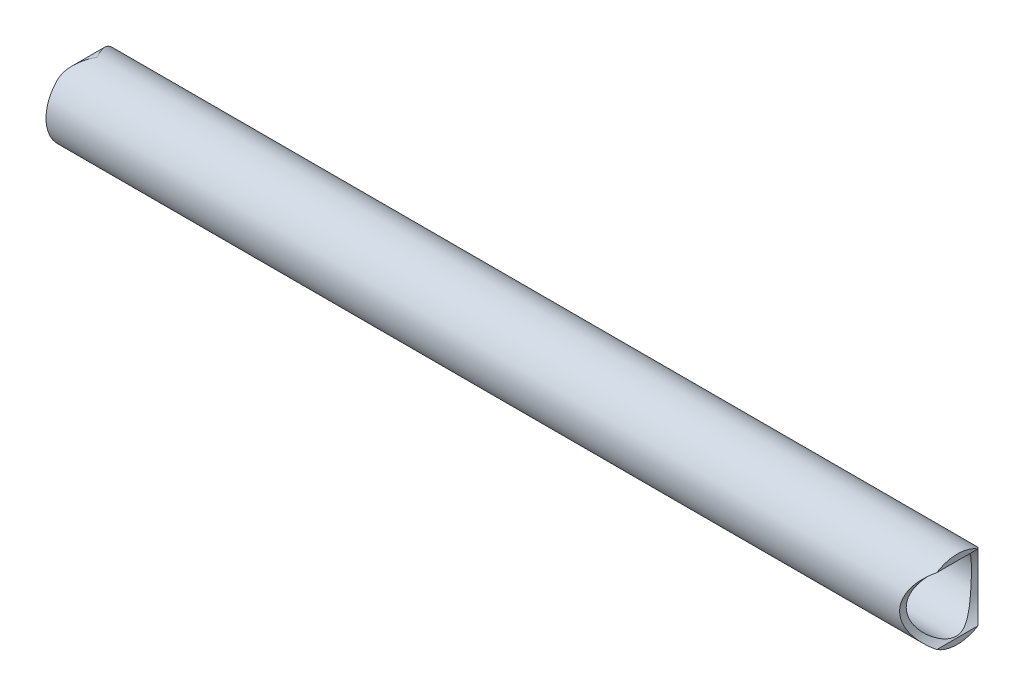
ISO-10303-21;
HEADER;
FILE_DESCRIPTION(('STEP AP214'),'2;1');
FILE_NAME('part.step','',(''),(''),'','','');
FILE_SCHEMA(('AUTOMOTIVE_DESIGN { 1 0 10303 214 1 1 1 1 }'));
ENDSEC;
DATA;
#1=APPLICATION_CONTEXT('core data for automotive mechanical design processes');
#2=APPLICATION_PROTOCOL_DEFINITION('international standard','automotive_design',2000,#1);
#3=PRODUCT_CONTEXT('',#1,'mechanical');
#4=PRODUCT('Part','Part','',(#3));
#5=PRODUCT_RELATED_PRODUCT_CATEGORY('part','',(#4));
#6=PRODUCT_DEFINITION_FORMATION('','',#4);
#7=PRODUCT_DEFINITION_CONTEXT('part definition',#1,'design');
#8=PRODUCT_DEFINITION('design','',#6,#7);
#9=PRODUCT_DEFINITION_SHAPE('','',#8);
#10=(LENGTH_UNIT() NAMED_UNIT(*) SI_UNIT(.MILLI.,.METRE.));
#11=(NAMED_UNIT(*) PLANE_ANGLE_UNIT() SI_UNIT($,.RADIAN.));
#12=(NAMED_UNIT(*) SI_UNIT($,.STERADIAN.) SOLID_ANGLE_UNIT());
#13=UNCERTAINTY_MEASURE_WITH_UNIT(LENGTH_MEASURE(1.E-05),#10,'distance_accuracy_value','');
#14=(GEOMETRIC_REPRESENTATION_CONTEXT(3) GLOBAL_UNCERTAINTY_ASSIGNED_CONTEXT((#13)) GLOBAL_UNIT_ASSIGNED_CONTEXT((#10,
#11,#12)) REPRESENTATION_CONTEXT('',''));
#15=CARTESIAN_POINT('',(0.,0.,0.));
#16=DIRECTION('',(0.,0.,1.));
#17=DIRECTION('',(1.,0.,0.));
#18=AXIS2_PLACEMENT_3D('',#15,#16,#17);
#19=CARTESIAN_POINT('',(469.10625,0.,0.));
#20=DIRECTION('',(1.,0.,0.));
#21=DIRECTION('',(0.,0.,-1.));
#22=AXIS2_PLACEMENT_3D('',#19,#20,#21);
#23=PLANE('',#22);
#24=DIRECTION('',(0.,0.,1.));
#25=VECTOR('',#24,1.);
#26=CARTESIAN_POINT('',(469.10625,17.9154421589309,-21.082));
#27=LINE('',#26,#25);
#28=CARTESIAN_POINT('',(469.10625,17.9154421589309,-11.1125));
#29=VERTEX_POINT('',#28);
#30=CARTESIAN_POINT('',(469.10625,17.915442158931,11.1125));
#31=VERTEX_POINT('',#30);
#32=EDGE_CURVE('E87',#29,#31,#27,.T.);
#33=ORIENTED_EDGE('',*,*,#32,.F.);
#34=CARTESIAN_POINT('',(469.10625,0.,0.));
#35=DIRECTION('',(1.,0.,0.));
#36=DIRECTION('',(0.,0.,-1.));
#37=AXIS2_PLACEMENT_3D('',#34,#35,#36);
#38=CIRCLE('',#37,21.082);
#39=EDGE_CURVE('E47',#29,#31,#38,.T.);
#40=ORIENTED_EDGE('',*,*,#39,.T.);
#41=EDGE_LOOP('',(#33,#40));
#42=FACE_BOUND('',#41,.T.);
#43=ADVANCED_FACE('F32',(#42),#23,.T.);
#44=DIRECTION('',(0.,0.,1.));
#45=VECTOR('',#44,1.);
#46=CARTESIAN_POINT('',(469.10625,-17.9154421589309,-21.082));
#47=LINE('',#46,#45);
#48=CARTESIAN_POINT('',(469.10625,-17.915442158931,11.1125));
#49=VERTEX_POINT('',#48);
#50=CARTESIAN_POINT('',(469.10625,-17.9154421589309,-11.1125));
#51=VERTEX_POINT('',#50);
#52=EDGE_CURVE('E84',#49,#51,#47,.F.);
#53=ORIENTED_EDGE('',*,*,#52,.F.);
#54=EDGE_CURVE('E92',#49,#51,#38,.T.);
#55=ORIENTED_EDGE('',*,*,#54,.T.);
#56=EDGE_LOOP('',(#53,#55));
#57=FACE_BOUND('',#56,.T.);
#58=ADVANCED_FACE('F91',(#57),#23,.T.);
#59=CARTESIAN_POINT('',(0.,0.,0.));
#60=DIRECTION('',(1.,0.,0.));
#61=DIRECTION('',(0.,0.,-1.));
#62=AXIS2_PLACEMENT_3D('',#59,#60,#61);
#63=PLANE('',#62);
#64=CARTESIAN_POINT('',(0.,0.,0.));
#65=DIRECTION('',(1.,0.,0.));
#66=DIRECTION('',(0.,0.,-1.));
#67=AXIS2_PLACEMENT_3D('',#64,#65,#66);
#68=CIRCLE('',#67,21.082);
#69=CARTESIAN_POINT('',(0.,14.732,15.0804144505382));
#70=VERTEX_POINT('',#69);
#71=CARTESIAN_POINT('',(0.,14.732,-15.0804144505382));
#72=VERTEX_POINT('',#71);
#73=EDGE_CURVE('E95',#70,#72,#68,.T.);
#74=ORIENTED_EDGE('',*,*,#73,.F.);
#75=DIRECTION('',(0.,0.,1.));
#76=VECTOR('',#75,1.);
#77=CARTESIAN_POINT('',(0.,14.732,-21.082));
#78=LINE('',#77,#76);
#79=CARTESIAN_POINT('',(0.,14.732,9.49362164824362));
#80=VERTEX_POINT('',#79);
#81=EDGE_CURVE('E125',#80,#70,#78,.T.);
#82=ORIENTED_EDGE('',*,*,#81,.F.);
#83=CARTESIAN_POINT('',(0.,0.,0.));
#84=DIRECTION('',(1.,0.,0.));
#85=DIRECTION('',(0.,0.,-1.));
#86=AXIS2_PLACEMENT_3D('',#83,#84,#85);
#87=CIRCLE('',#86,17.526);
#88=CARTESIAN_POINT('',(0.,14.732,-9.49362164824362));
#89=VERTEX_POINT('',#88);
#90=EDGE_CURVE('E98',#80,#89,#87,.T.);
#91=ORIENTED_EDGE('',*,*,#90,.T.);
#92=EDGE_CURVE('E61',#72,#89,#78,.T.);
#93=ORIENTED_EDGE('',*,*,#92,.F.);
#94=EDGE_LOOP('',(#74,#82,#91,#93));
#95=FACE_BOUND('',#94,.T.);
#96=ADVANCED_FACE('F138',(#95),#63,.F.);
#97=CARTESIAN_POINT('',(469.10625,0.,0.));
#98=DIRECTION('',(-1.,0.,0.));
#99=DIRECTION('',(0.,0.,1.));
#100=AXIS2_PLACEMENT_3D('',#97,#98,#99);
#101=CYLINDRICAL_SURFACE('',#100,21.082);
#102=ORIENTED_EDGE('',*,*,#73,.T.);
#103=CARTESIAN_POINT('',(0.,14.732,-15.0804144505382));
#104=CARTESIAN_POINT('',(4.99777097256306E-06,14.8585166363932,-14.9568250218965));
#105=CARTESIAN_POINT('',(0.0037804024379681,14.9834433145249,-14.8316684363902));
#106=CARTESIAN_POINT('',(0.018344612519162,15.2298802862784,-14.578499414352));
#107=CARTESIAN_POINT('',(0.0291313987626797,15.3513915529794,-14.4504878102679));
#108=CARTESIAN_POINT('',(0.0711641868780703,15.7100653220193,-14.0630095037458));
#109=CARTESIAN_POINT('',(0.112087001365868,15.9418874425845,-13.7995912481011));
#110=CARTESIAN_POINT('',(0.215488507432889,16.3879660671565,-13.2666880799684));
#111=CARTESIAN_POINT('',(0.277765297706076,16.6023646270495,-12.997281336883));
#112=CARTESIAN_POINT('',(0.420807437337394,17.0156387002352,-12.4513482602452));
#113=CARTESIAN_POINT('',(0.501584818248204,17.2145039983668,-12.1748173979638));
#114=CARTESIAN_POINT('',(0.722336490267377,17.6901137279932,-11.4788940830607));
#115=CARTESIAN_POINT('',(0.871915178025879,17.9572278098856,-11.0559422302578));
#116=CARTESIAN_POINT('',(1.19848542775072,18.4567086453977,-10.2003069203716));
#117=CARTESIAN_POINT('',(1.37548494857253,18.6890652721093,-9.76762066916));
#118=CARTESIAN_POINT('',(1.75209895067343,19.1211226362083,-8.89229878891464));
#119=CARTESIAN_POINT('',(1.9518397925665,19.3206241773796,-8.4496197349844));
#120=CARTESIAN_POINT('',(2.36824696498252,19.6862817768882,-7.55863388229215));
#121=CARTESIAN_POINT('',(2.58491234738668,19.8524397012882,-7.11032739995988));
#122=CARTESIAN_POINT('',(3.07854021979459,20.1841782782303,-6.11397748165988));
#123=CARTESIAN_POINT('',(3.35855407719812,20.3421826858222,-5.56492077807607));
#124=CARTESIAN_POINT('',(3.93195657278609,20.6121360645314,-4.46237555433802));
#125=CARTESIAN_POINT('',(4.2253492325938,20.7240710846151,-3.90888574337448));
#126=CARTESIAN_POINT('',(4.81966564824809,20.9026212412311,-2.80091191808466));
#127=CARTESIAN_POINT('',(5.12056407013035,20.9693718110366,-2.24643591433334));
#128=CARTESIAN_POINT('',(5.7263441140806,21.0587059818151,-1.13639917411688));
#129=CARTESIAN_POINT('',(6.0312234277849,21.0813141259917,-0.580839212441869));
#130=CARTESIAN_POINT('',(6.34068566822062,21.0819948744209,-0.0169715207830517));
#131=CARTESIAN_POINT('',(6.34534284661023,21.081999997751,-0.00848573804402203));
#132=CARTESIAN_POINT('',(6.35,21.082,0.));
#133=B_SPLINE_CURVE_WITH_KNOTS('',3,(#103,#104,#105,#106,#107,#108,#109,#110,#111,#112,#113,
#114,#115,#116,#117,#118,#119,#120,#121,#122,#123,#124,#125,#126,#127,#128,#129,#130,#131,#132),
.UNSPECIFIED.,.F.,.F.,(4,2,2,2,2,2,2,2,2,2,2,2,2,2,4),(0.,0.530465682198346,1.06077866603508,
2.11923257632368,3.16794284977036,4.21733708093636,5.78132496799527,7.34576765361523,
8.91937150261676,10.4928872609037,12.3996794344843,14.3070486112538,16.2086751300639,
18.1092440424708,18.1382833302831),.UNSPECIFIED.);
#134=CARTESIAN_POINT('',(6.35,21.082,0.));
#135=VERTEX_POINT('',#134);
#136=EDGE_CURVE('E124',#72,#135,#133,.T.);
#137=ORIENTED_EDGE('',*,*,#136,.T.);
#138=CARTESIAN_POINT('',(0.,14.732,15.0804144505382));
#139=CARTESIAN_POINT('',(4.99777097265902E-06,14.8585166363932,14.9568250218965));
#140=CARTESIAN_POINT('',(0.00378040243796859,14.983443314525,14.8316684363902));
#141=CARTESIAN_POINT('',(0.0183446125191639,15.2298802862785,14.5784994143519));
#142=CARTESIAN_POINT('',(0.0291313987626825,15.3513915529794,14.4504878102678));
#143=CARTESIAN_POINT('',(0.071164186878077,15.7100653220194,14.0630095037458));
#144=CARTESIAN_POINT('',(0.112087001365878,15.9418874425845,13.799591248101));
#145=CARTESIAN_POINT('',(0.215488507432905,16.3879660671565,13.2666880799683));
#146=CARTESIAN_POINT('',(0.277765297706091,16.6023646270495,12.9972813368829));
#147=CARTESIAN_POINT('',(0.420807437337405,17.0156387002352,12.4513482602451));
#148=CARTESIAN_POINT('',(0.501584818248212,17.2145039983668,12.1748173979638));
#149=CARTESIAN_POINT('',(0.722336490267378,17.6901137279932,11.4788940830607));
#150=CARTESIAN_POINT('',(0.871915178025876,17.9572278098856,11.0559422302578));
#151=CARTESIAN_POINT('',(1.19848542775071,18.4567086453976,10.2003069203717));
#152=CARTESIAN_POINT('',(1.37548494857251,18.6890652721093,9.76762066916005));
#153=CARTESIAN_POINT('',(1.75209895067341,19.1211226362082,8.89229878891469));
#154=CARTESIAN_POINT('',(1.95183979256649,19.3206241773795,8.44961973498444));
#155=CARTESIAN_POINT('',(2.36824696498251,19.6862817768881,7.55863388229216));
#156=CARTESIAN_POINT('',(2.58491234738667,19.8524397012882,7.11032739995988));
#157=CARTESIAN_POINT('',(3.0785402197946,20.1841782782303,6.11397748165988));
#158=CARTESIAN_POINT('',(3.35855407719814,20.3421826858222,5.56492077807609));
#159=CARTESIAN_POINT('',(3.93195657278606,20.6121360645314,4.462375554338));
#160=CARTESIAN_POINT('',(4.22534923259369,20.7240710846151,3.90888574337441));
#161=CARTESIAN_POINT('',(4.81966564824822,20.9026212412311,2.80091191808473));
#162=CARTESIAN_POINT('',(5.12056407013078,20.9693718110366,2.24643591433359));
#163=CARTESIAN_POINT('',(5.72634411408013,21.0587059818151,1.13639917411665));
#164=CARTESIAN_POINT('',(6.03122342778322,21.0813141259917,0.580839212440988));
#165=CARTESIAN_POINT('',(6.34068566822056,21.0819948744209,0.0169715207830728));
#166=CARTESIAN_POINT('',(6.3453428466102,21.081999997751,0.00848573804405541));
#167=CARTESIAN_POINT('',(6.35,21.082,0.));
#168=B_SPLINE_CURVE_WITH_KNOTS('',3,(#138,#139,#140,#141,#142,#143,#144,#145,#146,#147,#148,
#149,#150,#151,#152,#153,#154,#155,#156,#157,#158,#159,#160,#161,#162,#163,#164,#165,#166,#167),
.UNSPECIFIED.,.F.,.F.,(4,2,2,2,2,2,2,2,2,2,2,2,2,2,4),(0.,0.530465682198373,1.06077866603513,
2.11923257632378,3.16794284977042,4.21733708093637,5.78132496799524,7.34576765361516,
8.91937150261673,10.4928872609037,12.3996794344843,14.3070486112539,16.2086751300639,
18.1092440424708,18.1382833302831),.UNSPECIFIED.);
#169=EDGE_CURVE('E117',#135,#70,#168,.F.);
#170=ORIENTED_EDGE('',*,*,#169,.T.);
#171=EDGE_LOOP('',(#102,#137,#170));
#172=FACE_BOUND('',#171,.T.);
#173=ORIENTED_EDGE('',*,*,#39,.F.);
#174=CARTESIAN_POINT('',(480.21875,0.,0.));
#175=DIRECTION('',(-0.707106781186548,0.,0.707106781186547));
#176=DIRECTION('',(-0.707106781186548,0.,-0.707106781186547));
#177=AXIS2_PLACEMENT_3D('',#174,#175,#176);
#178=ELLIPSE('',#177,29.8144503219496,21.082);
#179=EDGE_CURVE('E94',#29,#51,#178,.T.);
#180=ORIENTED_EDGE('',*,*,#179,.T.);
#181=ORIENTED_EDGE('',*,*,#54,.F.);
#182=CARTESIAN_POINT('',(480.21875,0.,0.));
#183=DIRECTION('',(-0.707106781186548,0.,-0.707106781186547));
#184=DIRECTION('',(-0.707106781186548,0.,0.707106781186547));
#185=AXIS2_PLACEMENT_3D('',#182,#183,#184);
#186=ELLIPSE('',#185,29.8144503219496,21.082);
#187=EDGE_CURVE('E54',#49,#31,#186,.T.);
#188=ORIENTED_EDGE('',*,*,#187,.T.);
#189=EDGE_LOOP('',(#173,#180,#181,#188));
#190=FACE_BOUND('',#189,.T.);
#191=ADVANCED_FACE('F34',(#172,#190),#101,.T.);
#192=CARTESIAN_POINT('',(469.10625,0.,0.));
#193=DIRECTION('',(-1.,0.,0.));
#194=DIRECTION('',(0.,0.,1.));
#195=AXIS2_PLACEMENT_3D('',#192,#193,#194);
#196=CYLINDRICAL_SURFACE('',#195,17.526);
#197=CARTESIAN_POINT('',(459.13675,0.,17.526));
#198=CARTESIAN_POINT('',(459.136753100232,0.416555730228906,17.525996813955));
#199=CARTESIAN_POINT('',(459.149123313981,0.833163012071545,17.5111221446535));
#200=CARTESIAN_POINT('',(459.198320724751,1.66285085098589,17.4518957288154));
#201=CARTESIAN_POINT('',(459.235152005793,2.0759308074684,17.4075390599622));
#202=CARTESIAN_POINT('',(459.332452439066,2.89546158233793,17.2901260170745));
#203=CARTESIAN_POINT('',(459.392938843433,3.30190733638105,17.2170486963236));
#204=CARTESIAN_POINT('',(459.536212942405,4.10484124386305,17.0434647188049));
#205=CARTESIAN_POINT('',(459.619000210819,4.50132958743919,16.9429585862272));
#206=CARTESIAN_POINT('',(459.804608337995,5.27944797465432,16.7167963170662));
#207=CARTESIAN_POINT('',(459.907303655403,5.66115402240748,16.5912976561353));
#208=CARTESIAN_POINT('',(460.13114125938,6.41026860382347,16.3165047587702));
#209=CARTESIAN_POINT('',(460.252283245215,6.77767737045173,16.1672109102661));
#210=CARTESIAN_POINT('',(460.510997114563,7.49674702968466,15.8465909890381));
#211=CARTESIAN_POINT('',(460.648570010029,7.84840695050787,15.6752635592522));
#212=CARTESIAN_POINT('',(460.938082247339,8.53495429518089,15.3122852034019));
#213=CARTESIAN_POINT('',(461.090024633481,8.86983814178559,15.1206299696701));
#214=CARTESIAN_POINT('',(461.464140089599,9.64160099861961,14.6449374869007));
#215=CARTESIAN_POINT('',(461.691652769384,10.0709113512938,14.3527749107548));
#216=CARTESIAN_POINT('',(462.164488465582,10.8958978241818,13.7370028939555));
#217=CARTESIAN_POINT('',(462.409817485787,11.2915625079794,13.4133828401386));
#218=CARTESIAN_POINT('',(462.913798875036,12.049775776248,12.7366579401323));
#219=CARTESIAN_POINT('',(463.17248335067,12.4122381349312,12.3834806406871));
#220=CARTESIAN_POINT('',(463.697391944567,13.102805813699,11.6503545982694));
#221=CARTESIAN_POINT('',(463.963615114459,13.4309154311957,11.2704092138659));
#222=CARTESIAN_POINT('',(464.503016862729,14.0584742968281,10.4776077506457));
#223=CARTESIAN_POINT('',(464.776233749344,14.3572918160694,10.0642778803075));
#224=CARTESIAN_POINT('',(465.318313078632,14.9191165849368,9.21095532717234));
#225=CARTESIAN_POINT('',(465.587174038226,15.1821118547605,8.77095379548327));
#226=CARTESIAN_POINT('',(466.111691041438,15.6706637077535,7.86481925902692));
#227=CARTESIAN_POINT('',(466.367377460908,15.8963093356672,7.39875205622169));
#228=CARTESIAN_POINT('',(466.855669817722,16.3089147666568,6.43838077354218));
#229=CARTESIAN_POINT('',(467.088295378546,16.4959076106971,5.94410127510899));
#230=CARTESIAN_POINT('',(467.419892415188,16.7529770224336,5.15602712210236));
#231=CARTESIAN_POINT('',(467.531806838252,16.837735543251,4.872411200417));
#232=CARTESIAN_POINT('',(467.741705453925,16.9938564773723,4.29634473218566));
#233=CARTESIAN_POINT('',(467.83968784338,17.0652171570416,4.00389304799845));
#234=CARTESIAN_POINT('',(468.018453347219,17.1934754104678,3.41127303424146));
#235=CARTESIAN_POINT('',(468.099269928926,17.2504011700851,3.11112102298287));
#236=CARTESIAN_POINT('',(468.240783138788,17.3489622258268,2.503748224318));
#237=CARTESIAN_POINT('',(468.301490351692,17.3906055672393,2.19653124698383));
#238=CARTESIAN_POINT('',(468.400642338332,17.4581424184477,1.57275012439623));
#239=CARTESIAN_POINT('',(468.438798088988,17.4838316609619,1.25611705495765));
#240=CARTESIAN_POINT('',(468.489564384314,17.517930419636,0.619877416859227));
#241=CARTESIAN_POINT('',(468.502177230519,17.526341492641,0.300271118708478));
#242=CARTESIAN_POINT('',(468.501123738161,17.5256372212721,-0.338900631657943));
#243=CARTESIAN_POINT('',(468.487455708289,17.5165207489109,-0.658466079921118));
#244=CARTESIAN_POINT('',(468.434638550502,17.4810304342677,-1.29450990358539));
#245=CARTESIAN_POINT('',(468.395486264212,17.454654452937,-1.61098789140883));
#246=CARTESIAN_POINT('',(468.289324257895,17.3822895125155,-2.26597180787558));
#247=CARTESIAN_POINT('',(468.220160695607,17.3347748801548,-2.6039563959663));
#248=CARTESIAN_POINT('',(468.05798050578,17.2213863424108,-3.27094152568147));
#249=CARTESIAN_POINT('',(467.964960013026,17.1555094618906,-3.59994060193884));
#250=CARTESIAN_POINT('',(467.758998964524,17.0065131076897,-4.24855727345));
#251=CARTESIAN_POINT('',(467.64600613574,16.9233482836622,-4.56814761827544));
#252=CARTESIAN_POINT('',(467.404253660727,16.7410384013215,-5.19667563423267));
#253=CARTESIAN_POINT('',(467.275487866865,16.6418871073676,-5.50560909125264));
#254=CARTESIAN_POINT('',(466.927147015409,16.3663636741079,-6.28987340285503));
#255=CARTESIAN_POINT('',(466.698405644521,16.1786783054546,-6.75718011774374));
#256=CARTESIAN_POINT('',(466.221976191773,15.7683263145676,-7.66612047395263));
#257=CARTESIAN_POINT('',(465.974277188512,15.5456394491178,-8.10773905469757));
#258=CARTESIAN_POINT('',(465.468372952079,15.0664754392744,-8.96683638051191));
#259=CARTESIAN_POINT('',(465.21015403316,14.8099532398125,-9.38428185098054));
#260=CARTESIAN_POINT('',(464.690466965766,14.2641231324516,-10.1948087082538));
#261=CARTESIAN_POINT('',(464.428999471574,13.9748217341554,-10.5878949086503));
#262=CARTESIAN_POINT('',(463.895324879337,13.348195218157,-11.368790869149));
#263=CARTESIAN_POINT('',(463.623240901127,13.0091843032674,-11.7553355433847));
#264=CARTESIAN_POINT('',(463.087541373633,12.2951909614096,-12.5002060187878));
#265=CARTESIAN_POINT('',(462.823927094039,11.9202031744408,-12.8585276006225));
#266=CARTESIAN_POINT('',(462.311174827839,11.1350258886843,-13.5441070863272));
#267=CARTESIAN_POINT('',(462.062010084927,10.7249051788906,-13.8714231651622));
#268=CARTESIAN_POINT('',(461.7029705029,10.0834868401277,-14.3371461507588));
#269=CARTESIAN_POINT('',(461.585752726259,9.8653306424743,-14.4881649831134));
#270=CARTESIAN_POINT('',(461.356837871324,9.42027707168284,-14.7814103315513));
#271=CARTESIAN_POINT('',(461.245142151037,9.19337757252926,-14.9236346869964));
#272=CARTESIAN_POINT('',(460.973493112914,8.61498224084044,-15.2678084182525));
#273=CARTESIAN_POINT('',(460.817459068209,8.25811349099297,-15.4639027842676));
#274=CARTESIAN_POINT('',(460.521964191443,7.52616004996061,-15.8330525436508));
#275=CARTESIAN_POINT('',(460.382499423159,7.15107971509298,-16.0061134100713));
#276=CARTESIAN_POINT('',(460.122537175912,6.38410638575886,-16.3271734823368));
#277=CARTESIAN_POINT('',(460.00203301395,5.99221937735624,-16.4751815198914));
#278=CARTESIAN_POINT('',(459.782250109816,5.19343454244432,-16.7441479493523));
#279=CARTESIAN_POINT('',(459.682971726726,4.78653646212599,-16.8651058836479));
#280=CARTESIAN_POINT('',(459.507089403541,3.95712937963007,-17.0788335101842));
#281=CARTESIAN_POINT('',(459.430663185674,3.53452536865489,-17.1713824047497));
#282=CARTESIAN_POINT('',(459.30330895774,2.67986601870688,-17.325342710614));
#283=CARTESIAN_POINT('',(459.252380994275,2.24781066246181,-17.3867540650041));
#284=CARTESIAN_POINT('',(459.177324216148,1.37821649825806,-17.4771905064637));
#285=CARTESIAN_POINT('',(459.153182158585,0.940680508218323,-17.5062315973617));
#286=CARTESIAN_POINT('',(459.132290012414,0.0640313485043037,-17.5313661812511));
#287=CARTESIAN_POINT('',(459.135537074792,-0.37508165237985,-17.5274631010918));
#288=CARTESIAN_POINT('',(459.167335633984,-1.19930498558239,-17.4891990815668));
#289=CARTESIAN_POINT('',(459.192874675364,-1.58470875998572,-17.4584640327402));
#290=CARTESIAN_POINT('',(459.264684232639,-2.35069997583225,-17.3719144045829));
#291=CARTESIAN_POINT('',(459.310952802018,-2.73128786604044,-17.3161021800126));
#292=CARTESIAN_POINT('',(459.42332254399,-3.48513791526224,-17.1802563891461));
#293=CARTESIAN_POINT('',(459.489424907109,-3.85839963308743,-17.1002213688688));
#294=CARTESIAN_POINT('',(459.64024630486,-4.59536738648546,-16.9170761014037));
#295=CARTESIAN_POINT('',(459.724966273857,-4.95907294143571,-16.813964696073));
#296=CARTESIAN_POINT('',(459.913145504431,-5.68108005964255,-16.5840874699882));
#297=CARTESIAN_POINT('',(460.016895992016,-6.03918783157445,-16.4569529541794));
#298=CARTESIAN_POINT('',(460.240467917882,-6.74203119401674,-16.1817226350541));
#299=CARTESIAN_POINT('',(460.360289050715,-7.08676703852215,-16.033627230131));
#300=CARTESIAN_POINT('',(460.614268706947,-7.7617711253795,-15.7179651464271));
#301=CARTESIAN_POINT('',(460.748429245294,-8.09203732526567,-15.5503957309038));
#302=CARTESIAN_POINT('',(461.029307650088,-8.73727082208682,-15.1972398091077));
#303=CARTESIAN_POINT('',(461.176028031205,-9.05223503545283,-15.0116496938153));
#304=CARTESIAN_POINT('',(461.548812920572,-9.80464712063615,-14.5364034891831));
#305=CARTESIAN_POINT('',(461.780846995919,-10.2333578451482,-14.2375288779349));
#306=CARTESIAN_POINT('',(462.262358234905,-11.0565036944503,-13.6081978996813));
#307=CARTESIAN_POINT('',(462.511842112484,-11.4509254939542,-13.2777293585403));
#308=CARTESIAN_POINT('',(463.023748955069,-12.2062013475731,-12.5869774042746));
#309=CARTESIAN_POINT('',(463.286207884647,-12.5669530526875,-12.2266089972621));
#310=CARTESIAN_POINT('',(463.817996141297,-13.253470559835,-11.4788424530418));
#311=CARTESIAN_POINT('',(464.08732447637,-13.5792413783913,-11.091448204724));
#312=CARTESIAN_POINT('',(464.631962798302,-14.2012900820747,-10.2834169092844));
#313=CARTESIAN_POINT('',(464.907294003942,-14.4969406813881,-9.8623113113111));
#314=CARTESIAN_POINT('',(465.452322074852,-15.0517275612925,-8.99289776114401));
#315=CARTESIAN_POINT('',(465.722016777624,-15.3108500388738,-8.54457961710635));
#316=CARTESIAN_POINT('',(466.246222682617,-15.7906628138659,-7.62139093429989));
#317=CARTESIAN_POINT('',(466.500775922646,-16.0114631279653,-7.14660175430663));
#318=CARTESIAN_POINT('',(466.984149383237,-16.4132437140876,-6.16809279152978));
#319=CARTESIAN_POINT('',(467.212994501134,-16.5942626782093,-5.6644017261431));
#320=CARTESIAN_POINT('',(467.533166365567,-16.8388425611419,-4.86810478458098));
#321=CARTESIAN_POINT('',(467.63901918611,-16.9179225696371,-4.58604260557915));
#322=CARTESIAN_POINT('',(467.836250596365,-17.062806654192,-4.01353560636163));
#323=CARTESIAN_POINT('',(467.92763123726,-17.1286126119829,-3.72309198098292));
#324=CARTESIAN_POINT('',(468.092782938295,-17.2459247048064,-3.13503376582409));
#325=CARTESIAN_POINT('',(468.166590343537,-17.2974603903694,-2.83743540296246));
#326=CARTESIAN_POINT('',(468.29389080646,-17.3854671554674,-2.23575303013736));
#327=CARTESIAN_POINT('',(468.347389138256,-17.4219421463683,-1.93167072569972));
#328=CARTESIAN_POINT('',(468.432050986908,-17.4793343349965,-1.31542257105261));
#329=CARTESIAN_POINT('',(468.462959056324,-17.5000736934338,-1.00320440672016));
#330=CARTESIAN_POINT('',(468.499785417953,-17.524756770186,-0.376634351053846));
#331=CARTESIAN_POINT('',(468.505705534394,-17.5287017145648,-0.0622826171578791));
#332=CARTESIAN_POINT('',(468.492219236601,-17.519682115217,0.565765427557123));
#333=CARTESIAN_POINT('',(468.472801625762,-17.5067100959756,0.87946138722474));
#334=CARTESIAN_POINT('',(468.409708218613,-17.4642111799082,1.50326166249684));
#335=CARTESIAN_POINT('',(468.366029014212,-17.4346819572413,1.8133654672525));
#336=CARTESIAN_POINT('',(468.24947913328,-17.3549094765865,2.46783373112703));
#337=CARTESIAN_POINT('',(468.173539424602,-17.302463431889,2.81137909094881));
#338=CARTESIAN_POINT('',(467.99769360765,-17.1787080018257,3.48874159064592));
#339=CARTESIAN_POINT('',(467.897782550923,-17.1073947213456,3.82255670590954));
#340=CARTESIAN_POINT('',(467.678186596836,-16.947078987979,4.48018532937914));
#341=CARTESIAN_POINT('',(467.55845074705,-16.8580308311813,4.80397044519033));
#342=CARTESIAN_POINT('',(467.303531095877,-16.6635408359202,5.44039078400235));
#343=CARTESIAN_POINT('',(467.168341323107,-16.5580926547885,5.75302163536546));
#344=CARTESIAN_POINT('',(466.803678142386,-16.2655608949425,6.54686642927639));
#345=CARTESIAN_POINT('',(466.565311783285,-16.0668060807317,7.0197186237903));
#346=CARTESIAN_POINT('',(466.070778251224,-15.6331071713109,7.93883090279246));
#347=CARTESIAN_POINT('',(465.814601013657,-15.3981425218364,8.38507568297595));
#348=CARTESIAN_POINT('',(465.292991177891,-14.8931005076266,9.25247800104897));
#349=CARTESIAN_POINT('',(465.027546784682,-14.6229771058186,9.67360157184695));
#350=CARTESIAN_POINT('',(464.49479644847,-14.0485414814654,10.4903942108924));
#351=CARTESIAN_POINT('',(464.227490886297,-13.7442360709218,10.8860683262347));
#352=CARTESIAN_POINT('',(463.685008627962,-13.0872302237909,11.6686564771624));
#353=CARTESIAN_POINT('',(463.410011314537,-12.7329783860628,12.0543962817461));
#354=CARTESIAN_POINT('',(462.870324829164,-11.9872775461265,12.7961902436962));
#355=CARTESIAN_POINT('',(462.60563734665,-11.5958224834142,13.1522395466039));
#356=CARTESIAN_POINT('',(462.092856716602,-10.776623787392,13.8313916713883));
#357=CARTESIAN_POINT('',(461.844731277596,-10.3489546907981,14.1545592898452));
#358=CARTESIAN_POINT('',(461.489058671317,-9.6805538418048,14.6123392874479));
#359=CARTESIAN_POINT('',(461.373266967441,-9.45330032462178,14.7604208100894));
#360=CARTESIAN_POINT('',(461.147843154438,-8.98986303225831,15.0471693205303));
#361=CARTESIAN_POINT('',(461.03821252428,-8.7536771354263,15.1858340494738));
#362=CARTESIAN_POINT('',(460.777882456114,-8.16388969440334,15.5135810654738));
#363=CARTESIAN_POINT('',(460.631019615212,-7.80547285234025,15.6971201066552));
#364=CARTESIAN_POINT('',(460.354258282389,-7.07152507053722,16.0411475968501));
#365=CARTESIAN_POINT('',(460.224355748624,-6.69599823719479,16.2016415386992));
#366=CARTESIAN_POINT('',(459.983865788701,-5.92969186792639,16.4975121757086));
#367=CARTESIAN_POINT('',(459.873255954141,-5.53893068115682,16.6329180221441));
#368=CARTESIAN_POINT('',(459.673317296928,-4.74382214338575,16.8768969338328));
#369=CARTESIAN_POINT('',(459.583984673672,-4.33947723349805,16.9854747913174));
#370=CARTESIAN_POINT('',(459.445844180231,-3.61139042732534,17.1529959877094));
#371=CARTESIAN_POINT('',(459.392441530083,-3.2898093654496,17.2176086822695));
#372=CARTESIAN_POINT('',(459.300313709527,-2.64139463379433,17.3289327236608));
#373=CARTESIAN_POINT('',(459.261591366206,-2.31455996491102,17.3756406224611));
#374=CARTESIAN_POINT('',(459.199400717763,-1.657300955975,17.4505998410856));
#375=CARTESIAN_POINT('',(459.175933854947,-1.32687627951213,17.4788494157967));
#376=CARTESIAN_POINT('',(459.144609151471,-0.66431170552806,17.5165484873698));
#377=CARTESIAN_POINT('',(459.136747527795,-0.332172243283639,17.5260025406341));
#378=CARTESIAN_POINT('',(459.13675,0.,17.526));
#379=B_SPLINE_CURVE_WITH_KNOTS('',3,(#197,#198,#199,#200,#201,#202,#203,#204,#205,#206,#207,
#208,#209,#210,#211,#212,#213,#214,#215,#216,#217,#218,#219,#220,#221,#222,#223,#224,#225,#226,
#227,#228,#229,#230,#231,#232,#233,#234,#235,#236,#237,#238,#239,#240,#241,#242,#243,#244,#245,
#246,#247,#248,#249,#250,#251,#252,#253,#254,#255,#256,#257,#258,#259,#260,#261,#262,#263,#264,
#265,#266,#267,#268,#269,#270,#271,#272,#273,#274,#275,#276,#277,#278,#279,#280,#281,#282,#283,
#284,#285,#286,#287,#288,#289,#290,#291,#292,#293,#294,#295,#296,#297,#298,#299,#300,#301,#302,
#303,#304,#305,#306,#307,#308,#309,#310,#311,#312,#313,#314,#315,#316,#317,#318,#319,#320,#321,
#322,#323,#324,#325,#326,#327,#328,#329,#330,#331,#332,#333,#334,#335,#336,#337,#338,#339,#340,
#341,#342,#343,#344,#345,#346,#347,#348,#349,#350,#351,#352,#353,#354,#355,#356,#357,#358,#359,
#360,#361,#362,#363,#364,#365,#366,#367,#368,#369,#370,#371,#372,#373,#374,#375,#376,#377,#378),
.UNSPECIFIED.,.T.,.F.,(4,2,2,2,2,2,2,2,2,2,2,2,2,2,2,2,2,2,2,2,2,2,2,2,2,2,2,2,2,2,2,2,2,2,2,2,
2,2,2,2,2,2,2,2,2,2,2,2,2,2,2,2,2,2,2,2,2,2,2,2,2,2,2,2,2,2,2,2,2,2,2,2,2,2,2,2,2,2,2,2,2,2,2,2,
2,2,2,2,2,2,4),(0.,1.24931215514068,2.49883294793602,3.74926674484587,4.99967664647633,
6.24244384055415,7.48519077601582,8.72801428973392,9.97110169852848,11.6694991969452,
13.3684717049052,15.0717382323203,16.7747914316099,18.508900041403,20.2435871614538,
21.974077138334,23.7030816933734,24.6518793950268,25.6007997833557,26.5478527733324,
27.4944064783684,28.4528421356183,29.4111914294722,30.3696024000782,31.3281321733839,
32.3712679495731,33.4145728378166,34.4606499010713,35.5071359859366,37.1638893836605,
38.8216045193316,40.4815497807695,42.1411659704712,43.8844508919193,45.6279959405214,
47.3682019789461,48.238133531576,49.1082779678088,50.4151915777868,51.7217940919451,
53.0279350344375,54.3340980714494,55.6501696985348,56.9662437309291,58.2816668085292,
59.5969530576398,60.7579780281908,61.9188940006416,63.0798796712698,64.240923621771,
65.4214962902465,66.6020465231705,67.7827628635306,68.9637161565106,70.6766447530631,
72.3902360758568,74.1088773225334,75.8272717729951,77.5762157648221,79.3258188748362,
81.0703129492533,82.8131027115062,83.7469352207905,84.6806352566832,85.6123870984828,
86.5438968054863,87.4857834704328,88.4276013724583,89.3698355997799,90.3122022187916,
91.3777285366849,92.4434750028669,93.5120043575646,94.5809479956882,96.2751844313667,
97.9703861554526,99.6678303471317,101.364936859805,103.137598327809,104.910549063673,
106.679935458133,107.564410898222,108.449097758104,109.733689326203,111.01797419982,
112.300757301213,113.58331109564,114.579500372221,115.575881394522,116.57235660447,
117.568590219854),.UNSPECIFIED.);
#380=CARTESIAN_POINT('',(459.13675,0.,17.526));
#381=VERTEX_POINT('',#380);
#382=EDGE_CURVE('E37',#381,#381,#379,.T.);
#383=ORIENTED_EDGE('',*,*,#382,.F.);
#384=EDGE_LOOP('',(#383));
#385=FACE_BOUND('',#384,.T.);
#386=CARTESIAN_POINT('',(0.,14.732,-9.49362164824361));
#387=CARTESIAN_POINT('',(1.18215827092096E-05,14.8512065552147,-9.30864758850528));
#388=CARTESIAN_POINT('',(0.00335629290756961,14.966903733683,-9.12145207419103));
#389=CARTESIAN_POINT('',(0.015618373053566,15.191067778283,-8.74302268186063));
#390=CARTESIAN_POINT('',(0.024534469369689,15.2995365978256,-8.55178991342886));
#391=CARTESIAN_POINT('',(0.0468365894807759,15.5089823218411,-8.16580160022169));
#392=CARTESIAN_POINT('',(0.0602176995159619,15.6099673136364,-7.97105014964136));
#393=CARTESIAN_POINT('',(0.0904463086584942,15.8044598611726,-7.57811282719616));
#394=CARTESIAN_POINT('',(0.107294062917175,15.8979668658161,-7.3799267035169));
#395=CARTESIAN_POINT('',(0.161710749515973,16.1677428894095,-6.77922295697602));
#396=CARTESIAN_POINT('',(0.203066270989696,16.3325710230985,-6.37184299640371));
#397=CARTESIAN_POINT('',(0.28865530712156,16.6311343918077,-5.5460775193833));
#398=CARTESIAN_POINT('',(0.332889819449679,16.7648587740876,-5.12768821805969));
#399=CARTESIAN_POINT('',(0.420233364203613,17.0075279308424,-4.25683335736751));
#400=CARTESIAN_POINT('',(0.463124929061231,17.1145638855675,-3.80380674958994));
#401=CARTESIAN_POINT('',(0.519476718498732,17.2479052083383,-3.11843895481312));
#402=CARTESIAN_POINT('',(0.536930761583319,17.2878189125596,-2.88899376313145));
#403=CARTESIAN_POINT('',(0.568518618471742,17.3584967782642,-2.42847866805183));
#404=CARTESIAN_POINT('',(0.582652788803805,17.3892619223255,-2.19740894186361));
#405=CARTESIAN_POINT('',(0.60700831203503,17.4414967310561,-1.73463327297525));
#406=CARTESIAN_POINT('',(0.617239840917754,17.4629905896764,-1.50293059363321));
#407=CARTESIAN_POINT('',(0.633438941414769,17.4967389939057,-1.03872466306625));
#408=CARTESIAN_POINT('',(0.639406934130212,17.5089944519799,-0.806221493184098));
#409=CARTESIAN_POINT('',(0.646841906691908,17.5242321079992,-0.340835958369956));
#410=CARTESIAN_POINT('',(0.648308834845186,17.5272141994432,-0.107953589113738));
#411=CARTESIAN_POINT('',(0.646683444701061,17.5238958672413,0.357727673351307));
#412=CARTESIAN_POINT('',(0.64359113409545,17.5175954592557,0.590526566700303));
#413=CARTESIAN_POINT('',(0.633015011982841,17.4958254842557,1.05357258230511));
#414=CARTESIAN_POINT('',(0.625569519654457,17.4804359133699,1.28382432502859));
#415=CARTESIAN_POINT('',(0.606616305295421,17.4405997328694,1.74338121783046));
#416=CARTESIAN_POINT('',(0.595108185917324,17.416152237328,1.97268627309738));
#417=CARTESIAN_POINT('',(0.555116369049375,17.3293085585805,2.65858155894497));
#418=CARTESIAN_POINT('',(0.521163416818214,17.2534079290171,3.11322070575031));
#419=CARTESIAN_POINT('',(0.443683996229778,17.0661243267718,4.01506176899039));
#420=CARTESIAN_POINT('',(0.400139881988926,16.9546757811965,4.4622483212256));
#421=CARTESIAN_POINT('',(0.31015365623528,16.6970370744889,5.34616265629826));
#422=CARTESIAN_POINT('',(0.263712022198695,16.5508526263209,5.78289214600579));
#423=CARTESIAN_POINT('',(0.190296116221632,16.2789916862365,6.49992819615105));
#424=CARTESIAN_POINT('',(0.162003200675152,16.1627907207943,6.78372963515089));
#425=CARTESIAN_POINT('',(0.109990072823221,15.9155254057193,7.34511810644267));
#426=CARTESIAN_POINT('',(0.0862682339282398,15.7844663697057,7.62270731812361));
#427=CARTESIAN_POINT('',(0.0460592939801918,15.5080873202831,8.17029076843601));
#428=CARTESIAN_POINT('',(0.0295522145321793,15.3628080690132,8.44030401764001));
#429=CARTESIAN_POINT('',(0.00654051357353983,15.0579847067746,8.9728539714487));
#430=CARTESIAN_POINT('',(4.36685221627461E-05,14.898429607302,9.23538470802819));
#431=CARTESIAN_POINT('',(0.,14.732,9.49362164824361));
#432=B_SPLINE_CURVE_WITH_KNOTS('',3,(#386,#387,#388,#389,#390,#391,#392,#393,#394,#395,#396,
#397,#398,#399,#400,#401,#402,#403,#404,#405,#406,#407,#408,#409,#410,#411,#412,#413,#414,#415,
#416,#417,#418,#419,#420,#421,#422,#423,#424,#425,#426,#427,#428,#429,#430,#431),.UNSPECIFIED.,
.F.,.F.,(4,2,2,2,2,2,2,2,2,2,2,2,2,2,2,2,2,2,2,2,2,2,4),(0.,0.660061225427474,1.31994334467436,
1.97910164384406,2.6383084756313,3.96109639181251,5.2843451659066,6.68505552254074,
7.38551890925716,8.08590703728532,8.78445623939876,9.48293643762741,10.1814246575994,
10.8799116991686,11.5723409064333,12.2648378558842,13.6496257450175,15.0369829791431,
16.4241121943468,17.3476269451524,18.2708124595747,19.1914251291658,20.1127526175606),.UNSPECIFIED.);
#433=EDGE_CURVE('E11',#89,#80,#432,.T.);
#434=ORIENTED_EDGE('',*,*,#433,.F.);
#435=ORIENTED_EDGE('',*,*,#90,.F.);
#436=EDGE_LOOP('',(#434,#435));
#437=FACE_BOUND('',#436,.T.);
#438=ADVANCED_FACE('F107',(#385,#437),#196,.F.);
#439=CARTESIAN_POINT('',(6.35,14.732,-21.082));
#440=DIRECTION('',(0.,0.,1.));
#441=DIRECTION('',(1.,0.,0.));
#442=AXIS2_PLACEMENT_3D('',#439,#440,#441);
#443=CYLINDRICAL_SURFACE('',#442,6.35);
#444=ORIENTED_EDGE('',*,*,#92,.T.);
#445=ORIENTED_EDGE('',*,*,#433,.T.);
#446=ORIENTED_EDGE('',*,*,#81,.T.);
#447=ORIENTED_EDGE('',*,*,#169,.F.);
#448=ORIENTED_EDGE('',*,*,#136,.F.);
#449=EDGE_LOOP('',(#444,#445,#446,#447,#448));
#450=FACE_BOUND('',#449,.T.);
#451=ADVANCED_FACE('F110',(#450),#443,.T.);
#452=CARTESIAN_POINT('',(480.21875,0.,-21.082));
#453=DIRECTION('',(0.,0.,1.));
#454=DIRECTION('',(1.,0.,0.));
#455=AXIS2_PLACEMENT_3D('',#452,#453,#454);
#456=CYLINDRICAL_SURFACE('',#455,21.082);
#457=ORIENTED_EDGE('',*,*,#382,.T.);
#458=EDGE_LOOP('',(#457));
#459=FACE_BOUND('',#458,.T.);
#460=ORIENTED_EDGE('',*,*,#32,.T.);
#461=ORIENTED_EDGE('',*,*,#187,.F.);
#462=ORIENTED_EDGE('',*,*,#52,.T.);
#463=ORIENTED_EDGE('',*,*,#179,.F.);
#464=EDGE_LOOP('',(#460,#461,#462,#463));
#465=FACE_BOUND('',#464,.T.);
#466=ADVANCED_FACE('F83',(#459,#465),#456,.F.);
#467=CLOSED_SHELL('',(#43,#58,#96,#191,#438,#451,#466));
#468=MANIFOLD_SOLID_BREP('B2',#467);
#469=ADVANCED_BREP_SHAPE_REPRESENTATION('',(#18,#468),#14);
#470=SHAPE_DEFINITION_REPRESENTATION(#9,#469);
ENDSEC;
END-ISO-10303-21;
